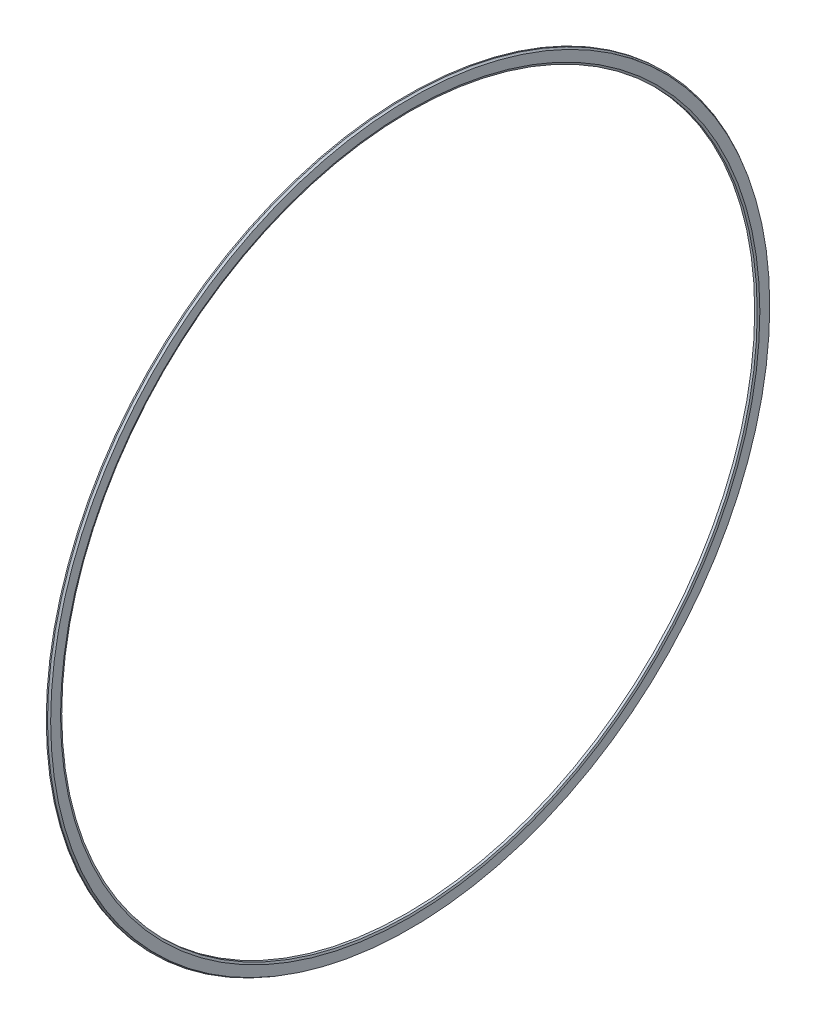
ISO-10303-21;
HEADER;
FILE_DESCRIPTION(('STEP AP214'),'2;1');
FILE_NAME('part.step','',(''),(''),'','','');
FILE_SCHEMA(('AUTOMOTIVE_DESIGN { 1 0 10303 214 1 1 1 1 }'));
ENDSEC;
DATA;
#1=APPLICATION_CONTEXT('core data for automotive mechanical design processes');
#2=APPLICATION_PROTOCOL_DEFINITION('international standard','automotive_design',2000,#1);
#3=PRODUCT_CONTEXT('',#1,'mechanical');
#4=PRODUCT('Part','Part','',(#3));
#5=PRODUCT_RELATED_PRODUCT_CATEGORY('part','',(#4));
#6=PRODUCT_DEFINITION_FORMATION('','',#4);
#7=PRODUCT_DEFINITION_CONTEXT('part definition',#1,'design');
#8=PRODUCT_DEFINITION('design','',#6,#7);
#9=PRODUCT_DEFINITION_SHAPE('','',#8);
#10=(LENGTH_UNIT() NAMED_UNIT(*) SI_UNIT(.MILLI.,.METRE.));
#11=(NAMED_UNIT(*) PLANE_ANGLE_UNIT() SI_UNIT($,.RADIAN.));
#12=(NAMED_UNIT(*) SI_UNIT($,.STERADIAN.) SOLID_ANGLE_UNIT());
#13=UNCERTAINTY_MEASURE_WITH_UNIT(LENGTH_MEASURE(1.E-05),#10,'distance_accuracy_value','');
#14=(GEOMETRIC_REPRESENTATION_CONTEXT(3) GLOBAL_UNCERTAINTY_ASSIGNED_CONTEXT((#13)) GLOBAL_UNIT_ASSIGNED_CONTEXT((#10,
#11,#12)) REPRESENTATION_CONTEXT('',''));
#15=CARTESIAN_POINT('',(0.,0.,0.));
#16=DIRECTION('',(0.,0.,1.));
#17=DIRECTION('',(1.,0.,0.));
#18=AXIS2_PLACEMENT_3D('',#15,#16,#17);
#19=CARTESIAN_POINT('',(0.,42.95,0.));
#20=DIRECTION('',(1.,0.,0.));
#21=DIRECTION('',(0.,0.,-1.));
#22=AXIS2_PLACEMENT_3D('',#19,#20,#21);
#23=PLANE('',#22);
#24=CARTESIAN_POINT('',(0.,0.,0.));
#25=DIRECTION('',(-1.,0.,0.));
#26=DIRECTION('',(0.,0.,1.));
#27=AXIS2_PLACEMENT_3D('',#24,#25,#26);
#28=CIRCLE('',#27,42.95);
#29=CARTESIAN_POINT('',(0.,0.,42.95));
#30=VERTEX_POINT('',#29);
#31=EDGE_CURVE('E10',#30,#30,#28,.T.);
#32=ORIENTED_EDGE('',*,*,#31,.F.);
#33=EDGE_LOOP('',(#32));
#34=FACE_BOUND('',#33,.T.);
#35=CARTESIAN_POINT('',(0.,0.,0.));
#36=DIRECTION('',(-1.,0.,0.));
#37=DIRECTION('',(0.,0.,1.));
#38=AXIS2_PLACEMENT_3D('',#35,#36,#37);
#39=CIRCLE('',#38,44.55);
#40=CARTESIAN_POINT('',(0.,0.,44.55));
#41=VERTEX_POINT('',#40);
#42=EDGE_CURVE('E54',#41,#41,#39,.T.);
#43=ORIENTED_EDGE('',*,*,#42,.T.);
#44=EDGE_LOOP('',(#43));
#45=FACE_BOUND('',#44,.T.);
#46=ADVANCED_FACE('F32',(#34,#45),#23,.F.);
#47=CARTESIAN_POINT('',(0.,0.,0.));
#48=DIRECTION('',(-1.,0.,0.));
#49=DIRECTION('',(0.,0.,1.));
#50=AXIS2_PLACEMENT_3D('',#47,#48,#49);
#51=CYLINDRICAL_SURFACE('',#50,42.95);
#52=CARTESIAN_POINT('',(0.312098655972971,0.,0.));
#53=DIRECTION('',(-1.,0.,0.));
#54=DIRECTION('',(0.,0.,1.));
#55=AXIS2_PLACEMENT_3D('',#52,#53,#54);
#56=CIRCLE('',#55,42.95);
#57=CARTESIAN_POINT('',(0.312098655972971,0.,42.95));
#58=VERTEX_POINT('',#57);
#59=EDGE_CURVE('E38',#58,#58,#56,.T.);
#60=ORIENTED_EDGE('',*,*,#59,.F.);
#61=EDGE_LOOP('',(#60));
#62=FACE_BOUND('',#61,.T.);
#63=ORIENTED_EDGE('',*,*,#31,.T.);
#64=EDGE_LOOP('',(#63));
#65=FACE_BOUND('',#64,.T.);
#66=ADVANCED_FACE('F79',(#62,#65),#51,.F.);
#67=CARTESIAN_POINT('',(0.312098655972971,0.,0.));
#68=DIRECTION('',(1.,0.,0.));
#69=DIRECTION('',(0.,0.,-1.));
#70=AXIS2_PLACEMENT_3D('',#67,#68,#69);
#71=CONICAL_SURFACE('',#70,42.95,1.21423780885152);
#72=CARTESIAN_POINT('',(0.399999999999999,0.,0.));
#73=DIRECTION('',(-1.,0.,0.));
#74=DIRECTION('',(0.,0.,1.));
#75=AXIS2_PLACEMENT_3D('',#72,#73,#74);
#76=CIRCLE('',#75,43.1859901609797);
#77=CARTESIAN_POINT('',(0.399999999999999,0.,43.1859901609797));
#78=VERTEX_POINT('',#77);
#79=EDGE_CURVE('E42',#78,#78,#76,.T.);
#80=ORIENTED_EDGE('',*,*,#79,.F.);
#81=EDGE_LOOP('',(#80));
#82=FACE_BOUND('',#81,.T.);
#83=ORIENTED_EDGE('',*,*,#59,.T.);
#84=EDGE_LOOP('',(#83));
#85=FACE_BOUND('',#84,.T.);
#86=ADVANCED_FACE('F74',(#82,#85),#71,.F.);
#87=CARTESIAN_POINT('',(0.399999999999999,44.4080370353463,0.));
#88=DIRECTION('',(-1.,0.,0.));
#89=DIRECTION('',(0.,0.,1.));
#90=AXIS2_PLACEMENT_3D('',#87,#88,#89);
#91=PLANE('',#90);
#92=CARTESIAN_POINT('',(0.399999999999999,0.,0.));
#93=DIRECTION('',(-1.,0.,0.));
#94=DIRECTION('',(0.,0.,1.));
#95=AXIS2_PLACEMENT_3D('',#92,#93,#94);
#96=CIRCLE('',#95,44.4080370353463);
#97=CARTESIAN_POINT('',(0.399999999999999,0.,44.4080370353463));
#98=VERTEX_POINT('',#97);
#99=EDGE_CURVE('E46',#98,#98,#96,.T.);
#100=ORIENTED_EDGE('',*,*,#99,.F.);
#101=EDGE_LOOP('',(#100));
#102=FACE_BOUND('',#101,.T.);
#103=ORIENTED_EDGE('',*,*,#79,.T.);
#104=EDGE_LOOP('',(#103));
#105=FACE_BOUND('',#104,.T.);
#106=ADVANCED_FACE('F68',(#102,#105),#91,.F.);
#107=CARTESIAN_POINT('',(0.440575948064244,0.,0.));
#108=DIRECTION('',(-1.,0.,0.));
#109=DIRECTION('',(0.,0.,1.));
#110=AXIS2_PLACEMENT_3D('',#107,#108,#109);
#111=TOROIDAL_SURFACE('',#110,44.7706015169227,0.364827919520984);
#112=CARTESIAN_POINT('',(0.15,0.,0.));
#113=DIRECTION('',(-1.,0.,0.));
#114=DIRECTION('',(0.,0.,1.));
#115=AXIS2_PLACEMENT_3D('',#112,#113,#114);
#116=CIRCLE('',#115,44.55);
#117=CARTESIAN_POINT('',(0.15,0.,44.55));
#118=VERTEX_POINT('',#117);
#119=EDGE_CURVE('E51',#118,#118,#116,.T.);
#120=ORIENTED_EDGE('',*,*,#119,.F.);
#121=EDGE_LOOP('',(#120));
#122=FACE_BOUND('',#121,.T.);
#123=ORIENTED_EDGE('',*,*,#99,.T.);
#124=EDGE_LOOP('',(#123));
#125=FACE_BOUND('',#124,.T.);
#126=ADVANCED_FACE('F62',(#122,#125),#111,.F.);
#127=CARTESIAN_POINT('',(0.,0.,0.));
#128=DIRECTION('',(-1.,0.,0.));
#129=DIRECTION('',(0.,0.,1.));
#130=AXIS2_PLACEMENT_3D('',#127,#128,#129);
#131=CYLINDRICAL_SURFACE('',#130,44.55);
#132=ORIENTED_EDGE('',*,*,#42,.F.);
#133=EDGE_LOOP('',(#132));
#134=FACE_BOUND('',#133,.T.);
#135=ORIENTED_EDGE('',*,*,#119,.T.);
#136=EDGE_LOOP('',(#135));
#137=FACE_BOUND('',#136,.T.);
#138=ADVANCED_FACE('F59',(#134,#137),#131,.T.);
#139=CLOSED_SHELL('',(#46,#66,#86,#106,#126,#138));
#140=MANIFOLD_SOLID_BREP('B2',#139);
#141=ADVANCED_BREP_SHAPE_REPRESENTATION('',(#18,#140),#14);
#142=SHAPE_DEFINITION_REPRESENTATION(#9,#141);
ENDSEC;
END-ISO-10303-21;
